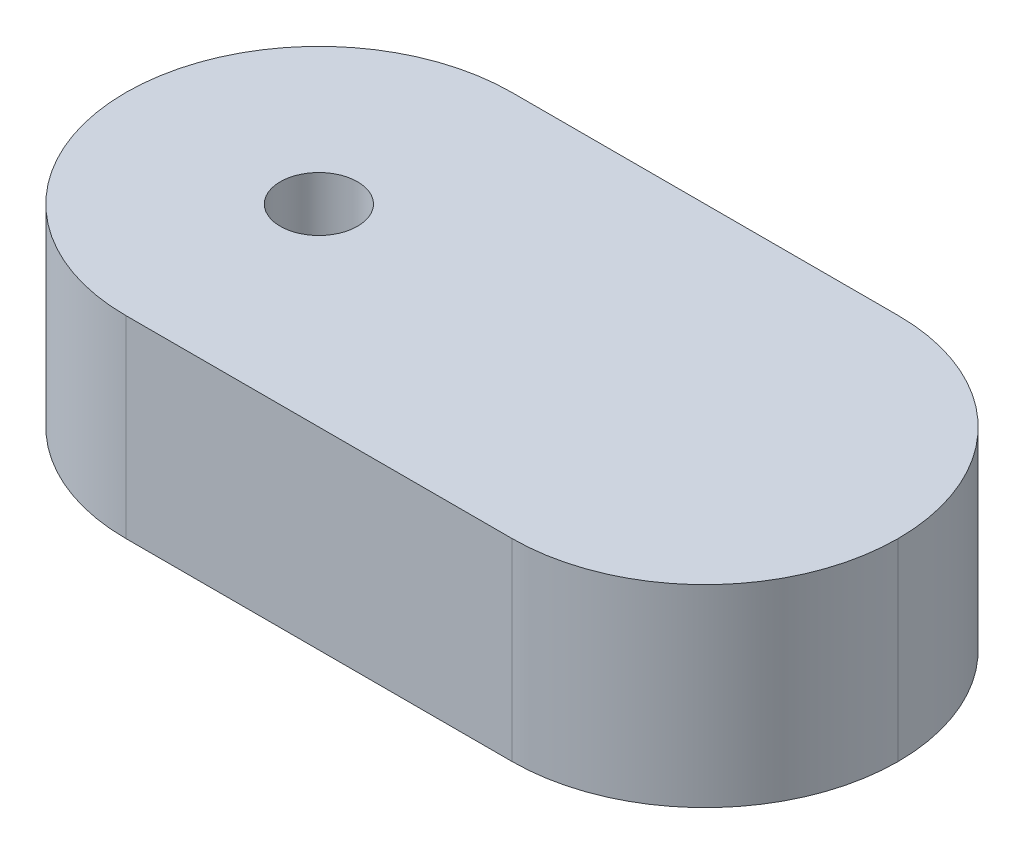
ISO-10303-21;
HEADER;
FILE_DESCRIPTION(('STEP AP214'),'2;1');
FILE_NAME('part.step','',(''),(''),'','','');
FILE_SCHEMA(('AUTOMOTIVE_DESIGN { 1 0 10303 214 1 1 1 1 }'));
ENDSEC;
DATA;
#1=APPLICATION_CONTEXT('core data for automotive mechanical design processes');
#2=APPLICATION_PROTOCOL_DEFINITION('international standard','automotive_design',2000,#1);
#3=PRODUCT_CONTEXT('',#1,'mechanical');
#4=PRODUCT('Part','Part','',(#3));
#5=PRODUCT_RELATED_PRODUCT_CATEGORY('part','',(#4));
#6=PRODUCT_DEFINITION_FORMATION('','',#4);
#7=PRODUCT_DEFINITION_CONTEXT('part definition',#1,'design');
#8=PRODUCT_DEFINITION('design','',#6,#7);
#9=PRODUCT_DEFINITION_SHAPE('','',#8);
#10=(LENGTH_UNIT() NAMED_UNIT(*) SI_UNIT(.MILLI.,.METRE.));
#11=(NAMED_UNIT(*) PLANE_ANGLE_UNIT() SI_UNIT($,.RADIAN.));
#12=(NAMED_UNIT(*) SI_UNIT($,.STERADIAN.) SOLID_ANGLE_UNIT());
#13=UNCERTAINTY_MEASURE_WITH_UNIT(LENGTH_MEASURE(1.E-05),#10,'distance_accuracy_value','');
#14=(GEOMETRIC_REPRESENTATION_CONTEXT(3) GLOBAL_UNCERTAINTY_ASSIGNED_CONTEXT((#13)) GLOBAL_UNIT_ASSIGNED_CONTEXT((#10,
#11,#12)) REPRESENTATION_CONTEXT('',''));
#15=CARTESIAN_POINT('',(0.,0.,0.));
#16=DIRECTION('',(0.,0.,1.));
#17=DIRECTION('',(1.,0.,0.));
#18=AXIS2_PLACEMENT_3D('',#15,#16,#17);
#19=CARTESIAN_POINT('',(-100.,50.,-50.));
#20=DIRECTION('',(0.,0.,1.));
#21=DIRECTION('',(1.,0.,0.));
#22=AXIS2_PLACEMENT_3D('',#19,#20,#21);
#23=PLANE('',#22);
#24=DIRECTION('',(-1.,0.,0.));
#25=VECTOR('',#24,1.);
#26=CARTESIAN_POINT('',(-100.,0.,-50.));
#27=LINE('',#26,#25);
#28=CARTESIAN_POINT('',(50.,0.,-50.));
#29=VERTEX_POINT('',#28);
#30=CARTESIAN_POINT('',(-50.,0.,-50.));
#31=VERTEX_POINT('',#30);
#32=EDGE_CURVE('E105',#29,#31,#27,.T.);
#33=ORIENTED_EDGE('',*,*,#32,.T.);
#34=DIRECTION('',(0.,-1.,0.));
#35=VECTOR('',#34,1.);
#36=CARTESIAN_POINT('',(-50.,50.,-50.));
#37=LINE('',#36,#35);
#38=CARTESIAN_POINT('',(-50.,50.,-50.));
#39=VERTEX_POINT('',#38);
#40=EDGE_CURVE('E160',#31,#39,#37,.F.);
#41=ORIENTED_EDGE('',*,*,#40,.T.);
#42=DIRECTION('',(-1.,0.,0.));
#43=VECTOR('',#42,1.);
#44=CARTESIAN_POINT('',(-100.,50.,-50.));
#45=LINE('',#44,#43);
#46=CARTESIAN_POINT('',(50.,50.,-50.));
#47=VERTEX_POINT('',#46);
#48=EDGE_CURVE('E141',#47,#39,#45,.T.);
#49=ORIENTED_EDGE('',*,*,#48,.F.);
#50=DIRECTION('',(0.,-1.,0.));
#51=VECTOR('',#50,1.);
#52=CARTESIAN_POINT('',(50.,50.,-50.));
#53=LINE('',#52,#51);
#54=EDGE_CURVE('E157',#47,#29,#53,.T.);
#55=ORIENTED_EDGE('',*,*,#54,.T.);
#56=EDGE_LOOP('',(#33,#41,#49,#55));
#57=FACE_BOUND('',#56,.T.);
#58=ADVANCED_FACE('F45',(#57),#23,.F.);
#59=CARTESIAN_POINT('',(-100.,50.,50.));
#60=DIRECTION('',(0.,0.,-1.));
#61=DIRECTION('',(-1.,0.,0.));
#62=AXIS2_PLACEMENT_3D('',#59,#60,#61);
#63=PLANE('',#62);
#64=DIRECTION('',(1.,0.,0.));
#65=VECTOR('',#64,1.);
#66=CARTESIAN_POINT('',(-100.,50.,50.));
#67=LINE('',#66,#65);
#68=CARTESIAN_POINT('',(-50.,50.,50.));
#69=VERTEX_POINT('',#68);
#70=CARTESIAN_POINT('',(50.,50.,50.));
#71=VERTEX_POINT('',#70);
#72=EDGE_CURVE('E118',#69,#71,#67,.T.);
#73=ORIENTED_EDGE('',*,*,#72,.F.);
#74=DIRECTION('',(0.,-1.,0.));
#75=VECTOR('',#74,1.);
#76=CARTESIAN_POINT('',(-50.,50.,50.));
#77=LINE('',#76,#75);
#78=CARTESIAN_POINT('',(-50.,0.,50.));
#79=VERTEX_POINT('',#78);
#80=EDGE_CURVE('E11',#69,#79,#77,.T.);
#81=ORIENTED_EDGE('',*,*,#80,.T.);
#82=DIRECTION('',(1.,0.,0.));
#83=VECTOR('',#82,1.);
#84=CARTESIAN_POINT('',(-100.,0.,50.));
#85=LINE('',#84,#83);
#86=CARTESIAN_POINT('',(50.,0.,50.));
#87=VERTEX_POINT('',#86);
#88=EDGE_CURVE('E145',#79,#87,#85,.T.);
#89=ORIENTED_EDGE('',*,*,#88,.T.);
#90=DIRECTION('',(0.,-1.,0.));
#91=VECTOR('',#90,1.);
#92=CARTESIAN_POINT('',(50.,50.,50.));
#93=LINE('',#92,#91);
#94=EDGE_CURVE('E55',#87,#71,#93,.F.);
#95=ORIENTED_EDGE('',*,*,#94,.T.);
#96=EDGE_LOOP('',(#73,#81,#89,#95));
#97=FACE_BOUND('',#96,.T.);
#98=ADVANCED_FACE('F188',(#97),#63,.F.);
#99=CARTESIAN_POINT('',(0.,50.,0.));
#100=DIRECTION('',(0.,-1.,0.));
#101=DIRECTION('',(0.,0.,-1.));
#102=AXIS2_PLACEMENT_3D('',#99,#100,#101);
#103=PLANE('',#102);
#104=CARTESIAN_POINT('',(-50.,50.,0.));
#105=DIRECTION('',(0.,-1.,0.));
#106=DIRECTION('',(0.,0.,-1.));
#107=AXIS2_PLACEMENT_3D('',#104,#105,#106);
#108=CIRCLE('',#107,10.);
#109=CARTESIAN_POINT('',(-50.,50.,-10.));
#110=VERTEX_POINT('',#109);
#111=EDGE_CURVE('E135',#110,#110,#108,.T.);
#112=ORIENTED_EDGE('',*,*,#111,.T.);
#113=EDGE_LOOP('',(#112));
#114=FACE_BOUND('',#113,.T.);
#115=ORIENTED_EDGE('',*,*,#48,.T.);
#116=CARTESIAN_POINT('',(-50.,50.,0.));
#117=DIRECTION('',(0.,-1.,0.));
#118=DIRECTION('',(0.,0.,-1.));
#119=AXIS2_PLACEMENT_3D('',#116,#117,#118);
#120=CIRCLE('',#119,50.);
#121=CARTESIAN_POINT('',(-100.,50.,0.));
#122=VERTEX_POINT('',#121);
#123=EDGE_CURVE('E171',#39,#122,#120,.F.);
#124=ORIENTED_EDGE('',*,*,#123,.T.);
#125=CARTESIAN_POINT('',(-50.,50.,0.));
#126=DIRECTION('',(0.,-1.,0.));
#127=DIRECTION('',(0.,0.,-1.));
#128=AXIS2_PLACEMENT_3D('',#125,#126,#127);
#129=CIRCLE('',#128,50.);
#130=EDGE_CURVE('E69',#122,#69,#129,.F.);
#131=ORIENTED_EDGE('',*,*,#130,.T.);
#132=ORIENTED_EDGE('',*,*,#72,.T.);
#133=CARTESIAN_POINT('',(50.,50.,0.));
#134=DIRECTION('',(0.,-1.,0.));
#135=DIRECTION('',(0.,0.,-1.));
#136=AXIS2_PLACEMENT_3D('',#133,#134,#135);
#137=CIRCLE('',#136,50.);
#138=CARTESIAN_POINT('',(100.,50.,0.));
#139=VERTEX_POINT('',#138);
#140=EDGE_CURVE('E164',#71,#139,#137,.F.);
#141=ORIENTED_EDGE('',*,*,#140,.T.);
#142=CARTESIAN_POINT('',(50.,50.,0.));
#143=DIRECTION('',(0.,-1.,0.));
#144=DIRECTION('',(0.,0.,-1.));
#145=AXIS2_PLACEMENT_3D('',#142,#143,#144);
#146=CIRCLE('',#145,50.);
#147=EDGE_CURVE('E121',#139,#47,#146,.F.);
#148=ORIENTED_EDGE('',*,*,#147,.T.);
#149=EDGE_LOOP('',(#115,#124,#131,#132,#141,#148));
#150=FACE_BOUND('',#149,.T.);
#151=ADVANCED_FACE('F175',(#114,#150),#103,.F.);
#152=CARTESIAN_POINT('',(0.,0.,0.));
#153=DIRECTION('',(0.,-1.,0.));
#154=DIRECTION('',(0.,0.,-1.));
#155=AXIS2_PLACEMENT_3D('',#152,#153,#154);
#156=PLANE('',#155);
#157=CARTESIAN_POINT('',(-50.,0.,0.));
#158=DIRECTION('',(0.,-1.,0.));
#159=DIRECTION('',(0.,0.,-1.));
#160=AXIS2_PLACEMENT_3D('',#157,#158,#159);
#161=CIRCLE('',#160,10.);
#162=CARTESIAN_POINT('',(-50.,0.,-10.));
#163=VERTEX_POINT('',#162);
#164=EDGE_CURVE('E138',#163,#163,#161,.T.);
#165=ORIENTED_EDGE('',*,*,#164,.F.);
#166=EDGE_LOOP('',(#165));
#167=FACE_BOUND('',#166,.T.);
#168=CARTESIAN_POINT('',(50.,0.,0.));
#169=DIRECTION('',(0.,-1.,0.));
#170=DIRECTION('',(0.,0.,-1.));
#171=AXIS2_PLACEMENT_3D('',#168,#169,#170);
#172=CIRCLE('',#171,15.);
#173=CARTESIAN_POINT('',(50.,0.,-15.));
#174=VERTEX_POINT('',#173);
#175=EDGE_CURVE('E129',#174,#174,#172,.T.);
#176=ORIENTED_EDGE('',*,*,#175,.F.);
#177=EDGE_LOOP('',(#176));
#178=FACE_BOUND('',#177,.T.);
#179=CARTESIAN_POINT('',(-50.,0.,0.));
#180=DIRECTION('',(0.,-1.,0.));
#181=DIRECTION('',(0.,0.,-1.));
#182=AXIS2_PLACEMENT_3D('',#179,#180,#181);
#183=CIRCLE('',#182,50.);
#184=CARTESIAN_POINT('',(-100.,0.,0.));
#185=VERTEX_POINT('',#184);
#186=EDGE_CURVE('E111',#79,#185,#183,.T.);
#187=ORIENTED_EDGE('',*,*,#186,.T.);
#188=CARTESIAN_POINT('',(-50.,0.,0.));
#189=DIRECTION('',(0.,-1.,0.));
#190=DIRECTION('',(0.,0.,-1.));
#191=AXIS2_PLACEMENT_3D('',#188,#189,#190);
#192=CIRCLE('',#191,50.);
#193=EDGE_CURVE('E154',#185,#31,#192,.T.);
#194=ORIENTED_EDGE('',*,*,#193,.T.);
#195=ORIENTED_EDGE('',*,*,#32,.F.);
#196=CARTESIAN_POINT('',(50.,0.,0.));
#197=DIRECTION('',(0.,-1.,0.));
#198=DIRECTION('',(0.,0.,-1.));
#199=AXIS2_PLACEMENT_3D('',#196,#197,#198);
#200=CIRCLE('',#199,50.);
#201=CARTESIAN_POINT('',(100.,0.,0.));
#202=VERTEX_POINT('',#201);
#203=EDGE_CURVE('E99',#29,#202,#200,.T.);
#204=ORIENTED_EDGE('',*,*,#203,.T.);
#205=CARTESIAN_POINT('',(50.,0.,0.));
#206=DIRECTION('',(0.,-1.,0.));
#207=DIRECTION('',(0.,0.,-1.));
#208=AXIS2_PLACEMENT_3D('',#205,#206,#207);
#209=CIRCLE('',#208,50.);
#210=EDGE_CURVE('E103',#202,#87,#209,.T.);
#211=ORIENTED_EDGE('',*,*,#210,.T.);
#212=ORIENTED_EDGE('',*,*,#88,.F.);
#213=EDGE_LOOP('',(#187,#194,#195,#204,#211,#212));
#214=FACE_BOUND('',#213,.T.);
#215=ADVANCED_FACE('F101',(#167,#178,#214),#156,.T.);
#216=CARTESIAN_POINT('',(-50.,50.,0.));
#217=DIRECTION('',(0.,-1.,0.));
#218=DIRECTION('',(0.,0.,-1.));
#219=AXIS2_PLACEMENT_3D('',#216,#217,#218);
#220=CYLINDRICAL_SURFACE('',#219,50.);
#221=ORIENTED_EDGE('',*,*,#80,.F.);
#222=ORIENTED_EDGE('',*,*,#130,.F.);
#223=DIRECTION('',(0.,-1.,0.));
#224=VECTOR('',#223,1.);
#225=CARTESIAN_POINT('',(-100.,50.,0.));
#226=LINE('',#225,#224);
#227=EDGE_CURVE('E123',#185,#122,#226,.F.);
#228=ORIENTED_EDGE('',*,*,#227,.F.);
#229=ORIENTED_EDGE('',*,*,#186,.F.);
#230=EDGE_LOOP('',(#221,#222,#228,#229));
#231=FACE_BOUND('',#230,.T.);
#232=ADVANCED_FACE('F182',(#231),#220,.T.);
#233=CARTESIAN_POINT('',(-50.,50.,0.));
#234=DIRECTION('',(0.,-1.,0.));
#235=DIRECTION('',(0.,0.,-1.));
#236=AXIS2_PLACEMENT_3D('',#233,#234,#235);
#237=CYLINDRICAL_SURFACE('',#236,50.);
#238=ORIENTED_EDGE('',*,*,#123,.F.);
#239=ORIENTED_EDGE('',*,*,#40,.F.);
#240=ORIENTED_EDGE('',*,*,#193,.F.);
#241=ORIENTED_EDGE('',*,*,#227,.T.);
#242=EDGE_LOOP('',(#238,#239,#240,#241));
#243=FACE_BOUND('',#242,.T.);
#244=ADVANCED_FACE('F185',(#243),#237,.T.);
#245=CARTESIAN_POINT('',(50.,50.,0.));
#246=DIRECTION('',(0.,-1.,0.));
#247=DIRECTION('',(0.,0.,-1.));
#248=AXIS2_PLACEMENT_3D('',#245,#246,#247);
#249=CYLINDRICAL_SURFACE('',#248,50.);
#250=DIRECTION('',(0.,-1.,0.));
#251=VECTOR('',#250,1.);
#252=CARTESIAN_POINT('',(100.,50.,0.));
#253=LINE('',#252,#251);
#254=EDGE_CURVE('E49',#139,#202,#253,.T.);
#255=ORIENTED_EDGE('',*,*,#254,.F.);
#256=ORIENTED_EDGE('',*,*,#140,.F.);
#257=ORIENTED_EDGE('',*,*,#94,.F.);
#258=ORIENTED_EDGE('',*,*,#210,.F.);
#259=EDGE_LOOP('',(#255,#256,#257,#258));
#260=FACE_BOUND('',#259,.T.);
#261=ADVANCED_FACE('F47',(#260),#249,.T.);
#262=CARTESIAN_POINT('',(50.,50.,0.));
#263=DIRECTION('',(0.,-1.,0.));
#264=DIRECTION('',(0.,0.,-1.));
#265=AXIS2_PLACEMENT_3D('',#262,#263,#264);
#266=CYLINDRICAL_SURFACE('',#265,50.);
#267=ORIENTED_EDGE('',*,*,#147,.F.);
#268=ORIENTED_EDGE('',*,*,#254,.T.);
#269=ORIENTED_EDGE('',*,*,#203,.F.);
#270=ORIENTED_EDGE('',*,*,#54,.F.);
#271=EDGE_LOOP('',(#267,#268,#269,#270));
#272=FACE_BOUND('',#271,.T.);
#273=ADVANCED_FACE('F120',(#272),#266,.T.);
#274=CARTESIAN_POINT('',(50.,25.,0.));
#275=DIRECTION('',(0.,-1.,0.));
#276=DIRECTION('',(0.,0.,-1.));
#277=AXIS2_PLACEMENT_3D('',#274,#275,#276);
#278=CYLINDRICAL_SURFACE('',#277,15.);
#279=CARTESIAN_POINT('',(50.,25.,0.));
#280=DIRECTION('',(0.,-1.,0.));
#281=DIRECTION('',(0.,0.,-1.));
#282=AXIS2_PLACEMENT_3D('',#279,#280,#281);
#283=CIRCLE('',#282,15.);
#284=CARTESIAN_POINT('',(50.,25.,-15.));
#285=VERTEX_POINT('',#284);
#286=EDGE_CURVE('E124',#285,#285,#283,.T.);
#287=ORIENTED_EDGE('',*,*,#286,.F.);
#288=EDGE_LOOP('',(#287));
#289=FACE_BOUND('',#288,.T.);
#290=ORIENTED_EDGE('',*,*,#175,.T.);
#291=EDGE_LOOP('',(#290));
#292=FACE_BOUND('',#291,.T.);
#293=ADVANCED_FACE('F200',(#289,#292),#278,.F.);
#294=CARTESIAN_POINT('',(50.,25.,0.));
#295=DIRECTION('',(0.,-1.,0.));
#296=DIRECTION('',(0.,0.,-1.));
#297=AXIS2_PLACEMENT_3D('',#294,#295,#296);
#298=PLANE('',#297);
#299=ORIENTED_EDGE('',*,*,#286,.T.);
#300=EDGE_LOOP('',(#299));
#301=FACE_BOUND('',#300,.T.);
#302=ADVANCED_FACE('F205',(#301),#298,.T.);
#303=CARTESIAN_POINT('',(-50.,50.,0.));
#304=DIRECTION('',(0.,-1.,0.));
#305=DIRECTION('',(0.,0.,-1.));
#306=AXIS2_PLACEMENT_3D('',#303,#304,#305);
#307=CYLINDRICAL_SURFACE('',#306,10.);
#308=ORIENTED_EDGE('',*,*,#111,.F.);
#309=EDGE_LOOP('',(#308));
#310=FACE_BOUND('',#309,.T.);
#311=ORIENTED_EDGE('',*,*,#164,.T.);
#312=EDGE_LOOP('',(#311));
#313=FACE_BOUND('',#312,.T.);
#314=ADVANCED_FACE('F251',(#310,#313),#307,.F.);
#315=CLOSED_SHELL('',(#58,#98,#151,#215,#232,#244,#261,#273,#293,#302,#314));
#316=MANIFOLD_SOLID_BREP('B2',#315);
#317=ADVANCED_BREP_SHAPE_REPRESENTATION('',(#18,#316),#14);
#318=SHAPE_DEFINITION_REPRESENTATION(#9,#317);
ENDSEC;
END-ISO-10303-21;
